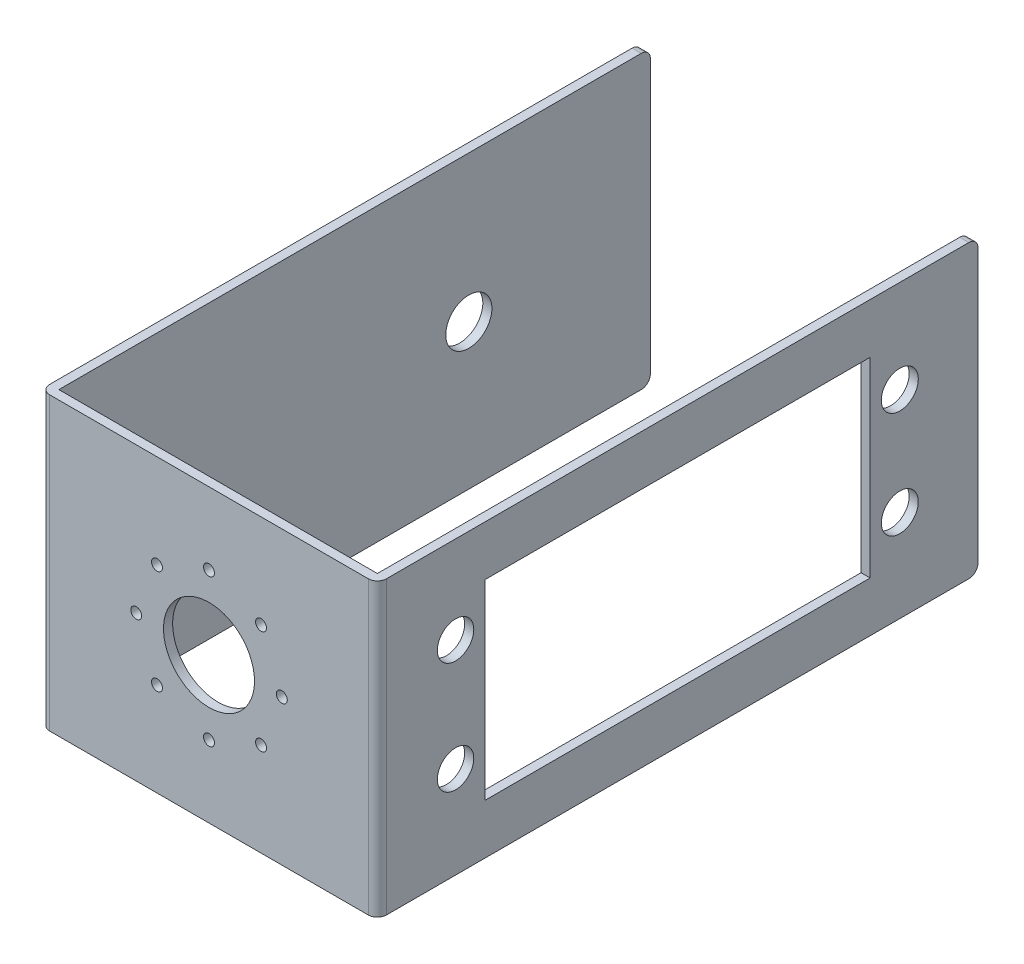
ISO-10303-21;
HEADER;
FILE_DESCRIPTION(('STEP AP214'),'2;1');
FILE_NAME('part.step','',(''),(''),'','','');
FILE_SCHEMA(('AUTOMOTIVE_DESIGN { 1 0 10303 214 1 1 1 1 }'));
ENDSEC;
DATA;
#1=APPLICATION_CONTEXT('core data for automotive mechanical design processes');
#2=APPLICATION_PROTOCOL_DEFINITION('international standard','automotive_design',2000,#1);
#3=PRODUCT_CONTEXT('',#1,'mechanical');
#4=PRODUCT('Part','Part','',(#3));
#5=PRODUCT_RELATED_PRODUCT_CATEGORY('part','',(#4));
#6=PRODUCT_DEFINITION_FORMATION('','',#4);
#7=PRODUCT_DEFINITION_CONTEXT('part definition',#1,'design');
#8=PRODUCT_DEFINITION('design','',#6,#7);
#9=PRODUCT_DEFINITION_SHAPE('','',#8);
#10=(LENGTH_UNIT() NAMED_UNIT(*) SI_UNIT(.MILLI.,.METRE.));
#11=(NAMED_UNIT(*) PLANE_ANGLE_UNIT() SI_UNIT($,.RADIAN.));
#12=(NAMED_UNIT(*) SI_UNIT($,.STERADIAN.) SOLID_ANGLE_UNIT());
#13=UNCERTAINTY_MEASURE_WITH_UNIT(LENGTH_MEASURE(1.E-05),#10,'distance_accuracy_value','');
#14=(GEOMETRIC_REPRESENTATION_CONTEXT(3) GLOBAL_UNCERTAINTY_ASSIGNED_CONTEXT((#13)) GLOBAL_UNIT_ASSIGNED_CONTEXT((#10,
#11,#12)) REPRESENTATION_CONTEXT('',''));
#15=CARTESIAN_POINT('',(0.,0.,0.));
#16=DIRECTION('',(0.,0.,1.));
#17=DIRECTION('',(1.,0.,0.));
#18=AXIS2_PLACEMENT_3D('',#15,#16,#17);
#19=CARTESIAN_POINT('',(18.5,32.,0.));
#20=DIRECTION('',(-1.,0.,0.));
#21=DIRECTION('',(0.,0.,1.));
#22=AXIS2_PLACEMENT_3D('',#19,#20,#21);
#23=PLANE('',#22);
#24=CARTESIAN_POINT('',(18.5,22.3852972044998,-7.59259474603742));
#25=DIRECTION('',(1.,0.,0.));
#26=DIRECTION('',(0.,0.,-1.));
#27=AXIS2_PLACEMENT_3D('',#24,#25,#26);
#28=CIRCLE('',#27,2.);
#29=CARTESIAN_POINT('',(18.5,22.3852972044998,-9.59259474603742));
#30=VERTEX_POINT('',#29);
#31=EDGE_CURVE('E306',#30,#30,#28,.T.);
#32=ORIENTED_EDGE('',*,*,#31,.F.);
#33=EDGE_LOOP('',(#32));
#34=FACE_BOUND('',#33,.T.);
#35=CARTESIAN_POINT('',(18.5,10.1155693309085,-7.59259474603743));
#36=DIRECTION('',(1.,0.,0.));
#37=DIRECTION('',(0.,0.,-1.));
#38=AXIS2_PLACEMENT_3D('',#35,#36,#37);
#39=CIRCLE('',#38,2.);
#40=CARTESIAN_POINT('',(18.5,10.1155693309085,-9.59259474603743));
#41=VERTEX_POINT('',#40);
#42=EDGE_CURVE('E312',#41,#41,#39,.T.);
#43=ORIENTED_EDGE('',*,*,#42,.F.);
#44=EDGE_LOOP('',(#43));
#45=FACE_BOUND('',#44,.T.);
#46=CARTESIAN_POINT('',(18.5,21.7935757158259,-56.4061379150047));
#47=DIRECTION('',(1.,0.,0.));
#48=DIRECTION('',(0.,0.,-1.));
#49=AXIS2_PLACEMENT_3D('',#46,#47,#48);
#50=CIRCLE('',#49,2.03257136074026);
#51=CARTESIAN_POINT('',(18.5,21.7935757158259,-58.438709275745));
#52=VERTEX_POINT('',#51);
#53=EDGE_CURVE('E301',#52,#52,#50,.T.);
#54=ORIENTED_EDGE('',*,*,#53,.F.);
#55=EDGE_LOOP('',(#54));
#56=FACE_BOUND('',#55,.T.);
#57=CARTESIAN_POINT('',(18.5,10.1155693309085,-56.4061379150047));
#58=DIRECTION('',(1.,0.,0.));
#59=DIRECTION('',(0.,0.,-1.));
#60=AXIS2_PLACEMENT_3D('',#57,#58,#59);
#61=CIRCLE('',#60,2.02805620219671);
#62=CARTESIAN_POINT('',(18.5,10.1155693309085,-58.4341941172014));
#63=VERTEX_POINT('',#62);
#64=EDGE_CURVE('E310',#63,#63,#61,.T.);
#65=ORIENTED_EDGE('',*,*,#64,.F.);
#66=EDGE_LOOP('',(#65));
#67=FACE_BOUND('',#66,.T.);
#68=DIRECTION('',(0.,0.,-1.));
#69=VECTOR('',#68,1.);
#70=CARTESIAN_POINT('',(18.5,5.5,-10.8525947460374));
#71=LINE('',#70,#69);
#72=CARTESIAN_POINT('',(18.5,5.5,-10.8525947460374));
#73=VERTEX_POINT('',#72);
#74=CARTESIAN_POINT('',(18.5,5.5,-53.1474052539626));
#75=VERTEX_POINT('',#74);
#76=EDGE_CURVE('E174',#73,#75,#71,.T.);
#77=ORIENTED_EDGE('',*,*,#76,.F.);
#78=DIRECTION('',(0.,-1.,0.));
#79=VECTOR('',#78,1.);
#80=CARTESIAN_POINT('',(18.5,26.5,-10.8525947460374));
#81=LINE('',#80,#79);
#82=CARTESIAN_POINT('',(18.5,26.5,-10.8525947460374));
#83=VERTEX_POINT('',#82);
#84=EDGE_CURVE('E53',#83,#73,#81,.T.);
#85=ORIENTED_EDGE('',*,*,#84,.F.);
#86=DIRECTION('',(0.,0.,1.));
#87=VECTOR('',#86,1.);
#88=CARTESIAN_POINT('',(18.5,26.5,-53.1474052539626));
#89=LINE('',#88,#87);
#90=CARTESIAN_POINT('',(18.5,26.5,-53.1474052539626));
#91=VERTEX_POINT('',#90);
#92=EDGE_CURVE('E180',#91,#83,#89,.T.);
#93=ORIENTED_EDGE('',*,*,#92,.F.);
#94=DIRECTION('',(0.,1.,0.));
#95=VECTOR('',#94,1.);
#96=CARTESIAN_POINT('',(18.5,5.5,-53.1474052539626));
#97=LINE('',#96,#95);
#98=EDGE_CURVE('E165',#75,#91,#97,.T.);
#99=ORIENTED_EDGE('',*,*,#98,.F.);
#100=EDGE_LOOP('',(#77,#85,#93,#99));
#101=FACE_BOUND('',#100,.T.);
#102=DIRECTION('',(0.,0.,-1.));
#103=VECTOR('',#102,1.);
#104=CARTESIAN_POINT('',(18.5,32.,0.));
#105=LINE('',#104,#103);
#106=CARTESIAN_POINT('',(18.5,32.,0.));
#107=VERTEX_POINT('',#106);
#108=CARTESIAN_POINT('',(18.5,32.,-64.));
#109=VERTEX_POINT('',#108);
#110=EDGE_CURVE('E190',#107,#109,#105,.T.);
#111=ORIENTED_EDGE('',*,*,#110,.F.);
#112=DIRECTION('',(0.,-1.,0.));
#113=VECTOR('',#112,1.);
#114=CARTESIAN_POINT('',(18.5,32.,0.));
#115=LINE('',#114,#113);
#116=CARTESIAN_POINT('',(18.5,0.,0.));
#117=VERTEX_POINT('',#116);
#118=EDGE_CURVE('E273',#107,#117,#115,.T.);
#119=ORIENTED_EDGE('',*,*,#118,.T.);
#120=DIRECTION('',(0.,0.,-1.));
#121=VECTOR('',#120,1.);
#122=CARTESIAN_POINT('',(18.5,0.,0.));
#123=LINE('',#122,#121);
#124=CARTESIAN_POINT('',(18.5,0.,-64.));
#125=VERTEX_POINT('',#124);
#126=EDGE_CURVE('E187',#117,#125,#123,.T.);
#127=ORIENTED_EDGE('',*,*,#126,.T.);
#128=CARTESIAN_POINT('',(18.5,1.,-64.));
#129=DIRECTION('',(-1.,0.,0.));
#130=DIRECTION('',(0.,0.,1.));
#131=AXIS2_PLACEMENT_3D('',#128,#129,#130);
#132=CIRCLE('',#131,1.);
#133=CARTESIAN_POINT('',(18.5,1.,-65.));
#134=VERTEX_POINT('',#133);
#135=EDGE_CURVE('E255',#125,#134,#132,.F.);
#136=ORIENTED_EDGE('',*,*,#135,.T.);
#137=DIRECTION('',(0.,-1.,0.));
#138=VECTOR('',#137,1.);
#139=CARTESIAN_POINT('',(18.5,32.,-65.));
#140=LINE('',#139,#138);
#141=CARTESIAN_POINT('',(18.5,31.,-65.));
#142=VERTEX_POINT('',#141);
#143=EDGE_CURVE('E230',#142,#134,#140,.T.);
#144=ORIENTED_EDGE('',*,*,#143,.F.);
#145=CARTESIAN_POINT('',(18.5,31.,-64.));
#146=DIRECTION('',(-1.,0.,0.));
#147=DIRECTION('',(0.,0.,1.));
#148=AXIS2_PLACEMENT_3D('',#145,#146,#147);
#149=CIRCLE('',#148,1.);
#150=EDGE_CURVE('E266',#142,#109,#149,.F.);
#151=ORIENTED_EDGE('',*,*,#150,.T.);
#152=EDGE_LOOP('',(#111,#119,#127,#136,#144,#151));
#153=FACE_BOUND('',#152,.T.);
#154=ADVANCED_FACE('F36',(#34,#45,#56,#67,#101,#153),#23,.F.);
#155=CARTESIAN_POINT('',(17.5,32.,-65.));
#156=DIRECTION('',(0.,0.,-1.));
#157=DIRECTION('',(-1.,0.,0.));
#158=AXIS2_PLACEMENT_3D('',#155,#156,#157);
#159=PLANE('',#158);
#160=DIRECTION('',(0.,-1.,0.));
#161=VECTOR('',#160,1.);
#162=CARTESIAN_POINT('',(17.5,32.,-65.));
#163=LINE('',#162,#161);
#164=CARTESIAN_POINT('',(17.5,31.,-65.));
#165=VERTEX_POINT('',#164);
#166=CARTESIAN_POINT('',(17.5,1.,-65.));
#167=VERTEX_POINT('',#166);
#168=EDGE_CURVE('E228',#165,#167,#163,.T.);
#169=ORIENTED_EDGE('',*,*,#168,.F.);
#170=DIRECTION('',(1.,0.,0.));
#171=VECTOR('',#170,1.);
#172=CARTESIAN_POINT('',(18.5,31.,-65.));
#173=LINE('',#172,#171);
#174=EDGE_CURVE('E263',#165,#142,#173,.T.);
#175=ORIENTED_EDGE('',*,*,#174,.T.);
#176=ORIENTED_EDGE('',*,*,#143,.T.);
#177=DIRECTION('',(1.,0.,0.));
#178=VECTOR('',#177,1.);
#179=CARTESIAN_POINT('',(17.5,1.,-65.));
#180=LINE('',#179,#178);
#181=EDGE_CURVE('E258',#134,#167,#180,.F.);
#182=ORIENTED_EDGE('',*,*,#181,.T.);
#183=EDGE_LOOP('',(#169,#175,#176,#182));
#184=FACE_BOUND('',#183,.T.);
#185=ADVANCED_FACE('F448',(#184),#159,.T.);
#186=CARTESIAN_POINT('',(17.5,32.,0.));
#187=DIRECTION('',(-1.,0.,0.));
#188=DIRECTION('',(0.,0.,1.));
#189=AXIS2_PLACEMENT_3D('',#186,#187,#188);
#190=PLANE('',#189);
#191=CARTESIAN_POINT('',(17.5,22.3852972044998,-7.59259474603742));
#192=DIRECTION('',(-1.,0.,0.));
#193=DIRECTION('',(0.,0.,1.));
#194=AXIS2_PLACEMENT_3D('',#191,#192,#193);
#195=CIRCLE('',#194,2.);
#196=CARTESIAN_POINT('',(17.5,22.3852972044998,-5.59259474603742));
#197=VERTEX_POINT('',#196);
#198=EDGE_CURVE('E40',#197,#197,#195,.T.);
#199=ORIENTED_EDGE('',*,*,#198,.F.);
#200=EDGE_LOOP('',(#199));
#201=FACE_BOUND('',#200,.T.);
#202=CARTESIAN_POINT('',(17.5,10.1155693309085,-7.59259474603743));
#203=DIRECTION('',(-1.,0.,0.));
#204=DIRECTION('',(0.,0.,1.));
#205=AXIS2_PLACEMENT_3D('',#202,#203,#204);
#206=CIRCLE('',#205,2.);
#207=CARTESIAN_POINT('',(17.5,10.1155693309085,-5.59259474603743));
#208=VERTEX_POINT('',#207);
#209=EDGE_CURVE('E304',#208,#208,#206,.T.);
#210=ORIENTED_EDGE('',*,*,#209,.F.);
#211=EDGE_LOOP('',(#210));
#212=FACE_BOUND('',#211,.T.);
#213=CARTESIAN_POINT('',(17.5,21.7935757158259,-56.4061379150047));
#214=DIRECTION('',(-1.,0.,0.));
#215=DIRECTION('',(0.,0.,1.));
#216=AXIS2_PLACEMENT_3D('',#213,#214,#215);
#217=CIRCLE('',#216,2.03257136074026);
#218=CARTESIAN_POINT('',(17.5,21.7935757158259,-54.3735665542644));
#219=VERTEX_POINT('',#218);
#220=EDGE_CURVE('E300',#219,#219,#217,.T.);
#221=ORIENTED_EDGE('',*,*,#220,.F.);
#222=EDGE_LOOP('',(#221));
#223=FACE_BOUND('',#222,.T.);
#224=CARTESIAN_POINT('',(17.5,10.1155693309085,-56.4061379150047));
#225=DIRECTION('',(-1.,0.,0.));
#226=DIRECTION('',(0.,0.,1.));
#227=AXIS2_PLACEMENT_3D('',#224,#225,#226);
#228=CIRCLE('',#227,2.02805620219671);
#229=CARTESIAN_POINT('',(17.5,10.1155693309085,-54.378081712808));
#230=VERTEX_POINT('',#229);
#231=EDGE_CURVE('E297',#230,#230,#228,.T.);
#232=ORIENTED_EDGE('',*,*,#231,.F.);
#233=EDGE_LOOP('',(#232));
#234=FACE_BOUND('',#233,.T.);
#235=DIRECTION('',(0.,1.,0.));
#236=VECTOR('',#235,1.);
#237=CARTESIAN_POINT('',(17.5,32.,-10.8525947460374));
#238=LINE('',#237,#236);
#239=CARTESIAN_POINT('',(17.5,5.5,-10.8525947460374));
#240=VERTEX_POINT('',#239);
#241=CARTESIAN_POINT('',(17.5,26.5,-10.8525947460374));
#242=VERTEX_POINT('',#241);
#243=EDGE_CURVE('E11',#240,#242,#238,.T.);
#244=ORIENTED_EDGE('',*,*,#243,.F.);
#245=DIRECTION('',(0.,0.,1.));
#246=VECTOR('',#245,1.);
#247=CARTESIAN_POINT('',(17.5,5.5,0.));
#248=LINE('',#247,#246);
#249=CARTESIAN_POINT('',(17.5,5.5,-53.1474052539626));
#250=VERTEX_POINT('',#249);
#251=EDGE_CURVE('E293',#250,#240,#248,.T.);
#252=ORIENTED_EDGE('',*,*,#251,.F.);
#253=DIRECTION('',(0.,-1.,0.));
#254=VECTOR('',#253,1.);
#255=CARTESIAN_POINT('',(17.5,32.,-53.1474052539626));
#256=LINE('',#255,#254);
#257=CARTESIAN_POINT('',(17.5,26.5,-53.1474052539626));
#258=VERTEX_POINT('',#257);
#259=EDGE_CURVE('E168',#258,#250,#256,.T.);
#260=ORIENTED_EDGE('',*,*,#259,.F.);
#261=DIRECTION('',(0.,0.,-1.));
#262=VECTOR('',#261,1.);
#263=CARTESIAN_POINT('',(17.5,26.5,0.));
#264=LINE('',#263,#262);
#265=EDGE_CURVE('E45',#242,#258,#264,.T.);
#266=ORIENTED_EDGE('',*,*,#265,.F.);
#267=EDGE_LOOP('',(#244,#252,#260,#266));
#268=FACE_BOUND('',#267,.T.);
#269=DIRECTION('',(0.,0.,-1.));
#270=VECTOR('',#269,1.);
#271=CARTESIAN_POINT('',(17.5,32.,0.));
#272=LINE('',#271,#270);
#273=CARTESIAN_POINT('',(17.5,32.,0.));
#274=VERTEX_POINT('',#273);
#275=CARTESIAN_POINT('',(17.5,32.,-64.));
#276=VERTEX_POINT('',#275);
#277=EDGE_CURVE('E192',#274,#276,#272,.T.);
#278=ORIENTED_EDGE('',*,*,#277,.T.);
#279=CARTESIAN_POINT('',(17.5,31.,-64.));
#280=DIRECTION('',(-1.,0.,0.));
#281=DIRECTION('',(0.,0.,1.));
#282=AXIS2_PLACEMENT_3D('',#279,#280,#281);
#283=CIRCLE('',#282,1.);
#284=EDGE_CURVE('E271',#276,#165,#283,.T.);
#285=ORIENTED_EDGE('',*,*,#284,.T.);
#286=ORIENTED_EDGE('',*,*,#168,.T.);
#287=CARTESIAN_POINT('',(17.5,1.,-64.));
#288=DIRECTION('',(-1.,0.,0.));
#289=DIRECTION('',(0.,0.,1.));
#290=AXIS2_PLACEMENT_3D('',#287,#288,#289);
#291=CIRCLE('',#290,1.);
#292=CARTESIAN_POINT('',(17.5,0.,-64.));
#293=VERTEX_POINT('',#292);
#294=EDGE_CURVE('E261',#167,#293,#291,.T.);
#295=ORIENTED_EDGE('',*,*,#294,.T.);
#296=DIRECTION('',(0.,0.,-1.));
#297=VECTOR('',#296,1.);
#298=CARTESIAN_POINT('',(17.5,0.,0.));
#299=LINE('',#298,#297);
#300=CARTESIAN_POINT('',(17.5,0.,0.));
#301=VERTEX_POINT('',#300);
#302=EDGE_CURVE('E208',#301,#293,#299,.T.);
#303=ORIENTED_EDGE('',*,*,#302,.F.);
#304=DIRECTION('',(0.,-1.,0.));
#305=VECTOR('',#304,1.);
#306=CARTESIAN_POINT('',(17.5,32.,0.));
#307=LINE('',#306,#305);
#308=EDGE_CURVE('E226',#274,#301,#307,.T.);
#309=ORIENTED_EDGE('',*,*,#308,.F.);
#310=EDGE_LOOP('',(#278,#285,#286,#295,#303,#309));
#311=FACE_BOUND('',#310,.T.);
#312=ADVANCED_FACE('F390',(#201,#212,#223,#234,#268,#311),#190,.T.);
#313=CARTESIAN_POINT('',(17.5,32.,0.));
#314=DIRECTION('',(0.,0.,-1.));
#315=DIRECTION('',(-1.,0.,0.));
#316=AXIS2_PLACEMENT_3D('',#313,#314,#315);
#317=PLANE('',#316);
#318=CARTESIAN_POINT('',(-8.,16.,0.));
#319=DIRECTION('',(0.,0.,-1.));
#320=DIRECTION('',(-1.,0.,0.));
#321=AXIS2_PLACEMENT_3D('',#318,#319,#320);
#322=CIRCLE('',#321,0.6);
#323=CARTESIAN_POINT('',(-8.6,16.,0.));
#324=VERTEX_POINT('',#323);
#325=EDGE_CURVE('E337',#324,#324,#322,.T.);
#326=ORIENTED_EDGE('',*,*,#325,.F.);
#327=EDGE_LOOP('',(#326));
#328=FACE_BOUND('',#327,.T.);
#329=CARTESIAN_POINT('',(8.,16.,0.));
#330=DIRECTION('',(0.,0.,-1.));
#331=DIRECTION('',(-1.,0.,0.));
#332=AXIS2_PLACEMENT_3D('',#329,#330,#331);
#333=CIRCLE('',#332,0.6);
#334=CARTESIAN_POINT('',(7.4,16.,0.));
#335=VERTEX_POINT('',#334);
#336=EDGE_CURVE('E332',#335,#335,#333,.T.);
#337=ORIENTED_EDGE('',*,*,#336,.F.);
#338=EDGE_LOOP('',(#337));
#339=FACE_BOUND('',#338,.T.);
#340=CARTESIAN_POINT('',(0.,7.91489241547921,0.));
#341=DIRECTION('',(0.,0.,-1.));
#342=DIRECTION('',(-1.,0.,0.));
#343=AXIS2_PLACEMENT_3D('',#340,#341,#342);
#344=CIRCLE('',#343,0.6);
#345=CARTESIAN_POINT('',(-0.6,7.91489241547921,0.));
#346=VERTEX_POINT('',#345);
#347=EDGE_CURVE('E373',#346,#346,#344,.T.);
#348=ORIENTED_EDGE('',*,*,#347,.F.);
#349=EDGE_LOOP('',(#348));
#350=FACE_BOUND('',#349,.T.);
#351=CARTESIAN_POINT('',(5.71703439963743,21.7170343996374,0.));
#352=DIRECTION('',(0.,0.,-1.));
#353=DIRECTION('',(-1.,0.,0.));
#354=AXIS2_PLACEMENT_3D('',#351,#352,#353);
#355=CIRCLE('',#354,0.6);
#356=CARTESIAN_POINT('',(5.11703439963743,21.7170343996374,0.));
#357=VERTEX_POINT('',#356);
#358=EDGE_CURVE('E370',#357,#357,#355,.T.);
#359=ORIENTED_EDGE('',*,*,#358,.F.);
#360=EDGE_LOOP('',(#359));
#361=FACE_BOUND('',#360,.T.);
#362=CARTESIAN_POINT('',(0.,24.0851075845208,0.));
#363=DIRECTION('',(0.,0.,-1.));
#364=DIRECTION('',(-1.,0.,0.));
#365=AXIS2_PLACEMENT_3D('',#362,#363,#364);
#366=CIRCLE('',#365,0.6);
#367=CARTESIAN_POINT('',(-0.6,24.0851075845208,0.));
#368=VERTEX_POINT('',#367);
#369=EDGE_CURVE('E367',#368,#368,#366,.T.);
#370=ORIENTED_EDGE('',*,*,#369,.F.);
#371=EDGE_LOOP('',(#370));
#372=FACE_BOUND('',#371,.T.);
#373=CARTESIAN_POINT('',(-5.71703439963739,10.2829656003625,0.));
#374=DIRECTION('',(0.,0.,-1.));
#375=DIRECTION('',(-1.,0.,0.));
#376=AXIS2_PLACEMENT_3D('',#373,#374,#375);
#377=CIRCLE('',#376,0.6);
#378=CARTESIAN_POINT('',(-6.31703439963739,10.2829656003625,0.));
#379=VERTEX_POINT('',#378);
#380=EDGE_CURVE('E364',#379,#379,#377,.T.);
#381=ORIENTED_EDGE('',*,*,#380,.F.);
#382=EDGE_LOOP('',(#381));
#383=FACE_BOUND('',#382,.T.);
#384=CARTESIAN_POINT('',(-5.71703439963747,21.7170343996374,0.));
#385=DIRECTION('',(0.,0.,-1.));
#386=DIRECTION('',(-1.,0.,0.));
#387=AXIS2_PLACEMENT_3D('',#384,#385,#386);
#388=CIRCLE('',#387,0.6);
#389=CARTESIAN_POINT('',(-6.31703439963747,21.7170343996374,0.));
#390=VERTEX_POINT('',#389);
#391=EDGE_CURVE('E361',#390,#390,#388,.T.);
#392=ORIENTED_EDGE('',*,*,#391,.F.);
#393=EDGE_LOOP('',(#392));
#394=FACE_BOUND('',#393,.T.);
#395=CARTESIAN_POINT('',(5.71703439963746,10.2829656003626,0.));
#396=DIRECTION('',(0.,0.,-1.));
#397=DIRECTION('',(-1.,0.,0.));
#398=AXIS2_PLACEMENT_3D('',#395,#396,#397);
#399=CIRCLE('',#398,0.6);
#400=CARTESIAN_POINT('',(5.11703439963746,10.2829656003626,0.));
#401=VERTEX_POINT('',#400);
#402=EDGE_CURVE('E344',#401,#401,#399,.T.);
#403=ORIENTED_EDGE('',*,*,#402,.F.);
#404=EDGE_LOOP('',(#403));
#405=FACE_BOUND('',#404,.T.);
#406=CARTESIAN_POINT('',(0.,16.,0.));
#407=DIRECTION('',(0.,0.,-1.));
#408=DIRECTION('',(-1.,0.,0.));
#409=AXIS2_PLACEMENT_3D('',#406,#407,#408);
#410=CIRCLE('',#409,5.);
#411=CARTESIAN_POINT('',(-5.,16.,0.));
#412=VERTEX_POINT('',#411);
#413=EDGE_CURVE('E379',#412,#412,#410,.T.);
#414=ORIENTED_EDGE('',*,*,#413,.F.);
#415=EDGE_LOOP('',(#414));
#416=FACE_BOUND('',#415,.T.);
#417=DIRECTION('',(1.,0.,0.));
#418=VECTOR('',#417,1.);
#419=CARTESIAN_POINT('',(17.5,0.,0.));
#420=LINE('',#419,#418);
#421=CARTESIAN_POINT('',(-17.5,0.,0.));
#422=VERTEX_POINT('',#421);
#423=EDGE_CURVE('E211',#422,#301,#420,.T.);
#424=ORIENTED_EDGE('',*,*,#423,.F.);
#425=DIRECTION('',(0.,-1.,0.));
#426=VECTOR('',#425,1.);
#427=CARTESIAN_POINT('',(-17.5,32.,0.));
#428=LINE('',#427,#426);
#429=CARTESIAN_POINT('',(-17.5,32.,0.));
#430=VERTEX_POINT('',#429);
#431=EDGE_CURVE('E223',#430,#422,#428,.T.);
#432=ORIENTED_EDGE('',*,*,#431,.F.);
#433=DIRECTION('',(1.,0.,0.));
#434=VECTOR('',#433,1.);
#435=CARTESIAN_POINT('',(17.5,32.,0.));
#436=LINE('',#435,#434);
#437=EDGE_CURVE('E196',#430,#274,#436,.T.);
#438=ORIENTED_EDGE('',*,*,#437,.T.);
#439=ORIENTED_EDGE('',*,*,#308,.T.);
#440=EDGE_LOOP('',(#424,#432,#438,#439));
#441=FACE_BOUND('',#440,.T.);
#442=ADVANCED_FACE('F386',(#328,#339,#350,#361,#372,#383,#394,#405,#416,#441),#317,.T.);
#443=CARTESIAN_POINT('',(-17.5,32.,0.));
#444=DIRECTION('',(1.,0.,0.));
#445=DIRECTION('',(0.,0.,-1.));
#446=AXIS2_PLACEMENT_3D('',#443,#444,#445);
#447=PLANE('',#446);
#448=CARTESIAN_POINT('',(-17.5,15.9397673385797,-45.049639152019));
#449=DIRECTION('',(1.,0.,0.));
#450=DIRECTION('',(0.,0.,-1.));
#451=AXIS2_PLACEMENT_3D('',#448,#449,#450);
#452=CIRCLE('',#451,2.53599158662607);
#453=CARTESIAN_POINT('',(-17.5,15.9397673385797,-47.5856307386451));
#454=VERTEX_POINT('',#453);
#455=EDGE_CURVE('E325',#454,#454,#452,.T.);
#456=ORIENTED_EDGE('',*,*,#455,.F.);
#457=EDGE_LOOP('',(#456));
#458=FACE_BOUND('',#457,.T.);
#459=DIRECTION('',(0.,-1.,0.));
#460=VECTOR('',#459,1.);
#461=CARTESIAN_POINT('',(-17.5,32.,-65.));
#462=LINE('',#461,#460);
#463=CARTESIAN_POINT('',(-17.5,31.,-65.));
#464=VERTEX_POINT('',#463);
#465=CARTESIAN_POINT('',(-17.5,1.,-65.));
#466=VERTEX_POINT('',#465);
#467=EDGE_CURVE('E221',#464,#466,#462,.T.);
#468=ORIENTED_EDGE('',*,*,#467,.F.);
#469=CARTESIAN_POINT('',(-17.5,31.,-64.));
#470=DIRECTION('',(1.,0.,0.));
#471=DIRECTION('',(0.,0.,-1.));
#472=AXIS2_PLACEMENT_3D('',#469,#470,#471);
#473=CIRCLE('',#472,1.);
#474=CARTESIAN_POINT('',(-17.5,32.,-64.));
#475=VERTEX_POINT('',#474);
#476=EDGE_CURVE('E246',#464,#475,#473,.T.);
#477=ORIENTED_EDGE('',*,*,#476,.T.);
#478=DIRECTION('',(0.,0.,1.));
#479=VECTOR('',#478,1.);
#480=CARTESIAN_POINT('',(-17.5,32.,0.));
#481=LINE('',#480,#479);
#482=EDGE_CURVE('E199',#475,#430,#481,.T.);
#483=ORIENTED_EDGE('',*,*,#482,.T.);
#484=ORIENTED_EDGE('',*,*,#431,.T.);
#485=DIRECTION('',(0.,0.,1.));
#486=VECTOR('',#485,1.);
#487=CARTESIAN_POINT('',(-17.5,0.,0.));
#488=LINE('',#487,#486);
#489=CARTESIAN_POINT('',(-17.5,0.,-64.));
#490=VERTEX_POINT('',#489);
#491=EDGE_CURVE('E214',#490,#422,#488,.T.);
#492=ORIENTED_EDGE('',*,*,#491,.F.);
#493=CARTESIAN_POINT('',(-17.5,1.,-64.));
#494=DIRECTION('',(1.,0.,0.));
#495=DIRECTION('',(0.,0.,-1.));
#496=AXIS2_PLACEMENT_3D('',#493,#494,#495);
#497=CIRCLE('',#496,1.);
#498=EDGE_CURVE('E235',#490,#466,#497,.T.);
#499=ORIENTED_EDGE('',*,*,#498,.T.);
#500=EDGE_LOOP('',(#468,#477,#483,#484,#492,#499));
#501=FACE_BOUND('',#500,.T.);
#502=ADVANCED_FACE('F389',(#458,#501),#447,.T.);
#503=CARTESIAN_POINT('',(-18.5,32.,-65.));
#504=DIRECTION('',(0.,0.,-1.));
#505=DIRECTION('',(-1.,0.,0.));
#506=AXIS2_PLACEMENT_3D('',#503,#504,#505);
#507=PLANE('',#506);
#508=DIRECTION('',(0.,-1.,0.));
#509=VECTOR('',#508,1.);
#510=CARTESIAN_POINT('',(-18.5,32.,-65.));
#511=LINE('',#510,#509);
#512=CARTESIAN_POINT('',(-18.5,31.,-65.));
#513=VERTEX_POINT('',#512);
#514=CARTESIAN_POINT('',(-18.5,1.,-65.));
#515=VERTEX_POINT('',#514);
#516=EDGE_CURVE('E206',#513,#515,#511,.T.);
#517=ORIENTED_EDGE('',*,*,#516,.F.);
#518=DIRECTION('',(1.,0.,0.));
#519=VECTOR('',#518,1.);
#520=CARTESIAN_POINT('',(-17.5,31.,-65.));
#521=LINE('',#520,#519);
#522=EDGE_CURVE('E243',#513,#464,#521,.T.);
#523=ORIENTED_EDGE('',*,*,#522,.T.);
#524=ORIENTED_EDGE('',*,*,#467,.T.);
#525=DIRECTION('',(1.,0.,0.));
#526=VECTOR('',#525,1.);
#527=CARTESIAN_POINT('',(-18.5,1.,-65.));
#528=LINE('',#527,#526);
#529=EDGE_CURVE('E238',#466,#515,#528,.F.);
#530=ORIENTED_EDGE('',*,*,#529,.T.);
#531=EDGE_LOOP('',(#517,#523,#524,#530));
#532=FACE_BOUND('',#531,.T.);
#533=ADVANCED_FACE('F420',(#532),#507,.T.);
#534=CARTESIAN_POINT('',(-18.5,32.,0.));
#535=DIRECTION('',(1.,0.,0.));
#536=DIRECTION('',(0.,0.,-1.));
#537=AXIS2_PLACEMENT_3D('',#534,#535,#536);
#538=PLANE('',#537);
#539=CARTESIAN_POINT('',(-18.5,15.9397673385797,-45.049639152019));
#540=DIRECTION('',(-1.,0.,0.));
#541=DIRECTION('',(0.,0.,1.));
#542=AXIS2_PLACEMENT_3D('',#539,#540,#541);
#543=CIRCLE('',#542,2.53599158662607);
#544=CARTESIAN_POINT('',(-18.5,15.9397673385797,-42.5136475653929));
#545=VERTEX_POINT('',#544);
#546=EDGE_CURVE('E303',#545,#545,#543,.T.);
#547=ORIENTED_EDGE('',*,*,#546,.F.);
#548=EDGE_LOOP('',(#547));
#549=FACE_BOUND('',#548,.T.);
#550=DIRECTION('',(0.,0.,-1.));
#551=VECTOR('',#550,1.);
#552=CARTESIAN_POINT('',(-18.5,0.,0.));
#553=LINE('',#552,#551);
#554=CARTESIAN_POINT('',(-18.5,0.,-64.));
#555=VERTEX_POINT('',#554);
#556=CARTESIAN_POINT('',(-18.5,0.,0.));
#557=VERTEX_POINT('',#556);
#558=EDGE_CURVE('E216',#555,#557,#553,.F.);
#559=ORIENTED_EDGE('',*,*,#558,.T.);
#560=DIRECTION('',(0.,-1.,0.));
#561=VECTOR('',#560,1.);
#562=CARTESIAN_POINT('',(-18.5,32.,0.));
#563=LINE('',#562,#561);
#564=CARTESIAN_POINT('',(-18.5,32.,0.));
#565=VERTEX_POINT('',#564);
#566=EDGE_CURVE('E289',#557,#565,#563,.F.);
#567=ORIENTED_EDGE('',*,*,#566,.T.);
#568=DIRECTION('',(0.,0.,-1.));
#569=VECTOR('',#568,1.);
#570=CARTESIAN_POINT('',(-18.5,32.,0.));
#571=LINE('',#570,#569);
#572=CARTESIAN_POINT('',(-18.5,32.,-64.));
#573=VERTEX_POINT('',#572);
#574=EDGE_CURVE('E201',#573,#565,#571,.F.);
#575=ORIENTED_EDGE('',*,*,#574,.F.);
#576=CARTESIAN_POINT('',(-18.5,31.,-64.));
#577=DIRECTION('',(1.,0.,0.));
#578=DIRECTION('',(0.,0.,-1.));
#579=AXIS2_PLACEMENT_3D('',#576,#577,#578);
#580=CIRCLE('',#579,1.);
#581=EDGE_CURVE('E250',#573,#513,#580,.F.);
#582=ORIENTED_EDGE('',*,*,#581,.T.);
#583=ORIENTED_EDGE('',*,*,#516,.T.);
#584=CARTESIAN_POINT('',(-18.5,1.,-64.));
#585=DIRECTION('',(1.,0.,0.));
#586=DIRECTION('',(0.,0.,-1.));
#587=AXIS2_PLACEMENT_3D('',#584,#585,#586);
#588=CIRCLE('',#587,1.);
#589=EDGE_CURVE('E241',#515,#555,#588,.F.);
#590=ORIENTED_EDGE('',*,*,#589,.T.);
#591=EDGE_LOOP('',(#559,#567,#575,#582,#583,#590));
#592=FACE_BOUND('',#591,.T.);
#593=ADVANCED_FACE('F418',(#549,#592),#538,.F.);
#594=CARTESIAN_POINT('',(17.5,32.,0.999999999999994));
#595=DIRECTION('',(0.,0.,-1.));
#596=DIRECTION('',(-1.,0.,0.));
#597=AXIS2_PLACEMENT_3D('',#594,#595,#596);
#598=PLANE('',#597);
#599=CARTESIAN_POINT('',(-8.,16.,1.));
#600=DIRECTION('',(0.,0.,1.));
#601=DIRECTION('',(1.,0.,0.));
#602=AXIS2_PLACEMENT_3D('',#599,#600,#601);
#603=CIRCLE('',#602,0.6);
#604=CARTESIAN_POINT('',(-7.4,16.,1.));
#605=VERTEX_POINT('',#604);
#606=EDGE_CURVE('E329',#605,#605,#603,.T.);
#607=ORIENTED_EDGE('',*,*,#606,.F.);
#608=EDGE_LOOP('',(#607));
#609=FACE_BOUND('',#608,.T.);
#610=CARTESIAN_POINT('',(8.,16.,1.));
#611=DIRECTION('',(0.,0.,1.));
#612=DIRECTION('',(1.,0.,0.));
#613=AXIS2_PLACEMENT_3D('',#610,#611,#612);
#614=CIRCLE('',#613,0.6);
#615=CARTESIAN_POINT('',(8.6,16.,1.));
#616=VERTEX_POINT('',#615);
#617=EDGE_CURVE('E328',#616,#616,#614,.T.);
#618=ORIENTED_EDGE('',*,*,#617,.F.);
#619=EDGE_LOOP('',(#618));
#620=FACE_BOUND('',#619,.T.);
#621=CARTESIAN_POINT('',(0.,7.91489241547921,1.));
#622=DIRECTION('',(0.,0.,1.));
#623=DIRECTION('',(1.,0.,0.));
#624=AXIS2_PLACEMENT_3D('',#621,#622,#623);
#625=CIRCLE('',#624,0.6);
#626=CARTESIAN_POINT('',(0.6,7.91489241547921,1.));
#627=VERTEX_POINT('',#626);
#628=EDGE_CURVE('E341',#627,#627,#625,.T.);
#629=ORIENTED_EDGE('',*,*,#628,.F.);
#630=EDGE_LOOP('',(#629));
#631=FACE_BOUND('',#630,.T.);
#632=CARTESIAN_POINT('',(5.71703439963743,21.7170343996374,1.));
#633=DIRECTION('',(0.,0.,1.));
#634=DIRECTION('',(1.,0.,0.));
#635=AXIS2_PLACEMENT_3D('',#632,#633,#634);
#636=CIRCLE('',#635,0.6);
#637=CARTESIAN_POINT('',(6.31703439963743,21.7170343996374,1.));
#638=VERTEX_POINT('',#637);
#639=EDGE_CURVE('E340',#638,#638,#636,.T.);
#640=ORIENTED_EDGE('',*,*,#639,.F.);
#641=EDGE_LOOP('',(#640));
#642=FACE_BOUND('',#641,.T.);
#643=CARTESIAN_POINT('',(0.,24.0851075845208,1.));
#644=DIRECTION('',(0.,0.,1.));
#645=DIRECTION('',(1.,0.,0.));
#646=AXIS2_PLACEMENT_3D('',#643,#644,#645);
#647=CIRCLE('',#646,0.6);
#648=CARTESIAN_POINT('',(0.6,24.0851075845208,1.));
#649=VERTEX_POINT('',#648);
#650=EDGE_CURVE('E345',#649,#649,#647,.T.);
#651=ORIENTED_EDGE('',*,*,#650,.F.);
#652=EDGE_LOOP('',(#651));
#653=FACE_BOUND('',#652,.T.);
#654=CARTESIAN_POINT('',(-5.71703439963739,10.2829656003625,1.));
#655=DIRECTION('',(0.,0.,1.));
#656=DIRECTION('',(1.,0.,0.));
#657=AXIS2_PLACEMENT_3D('',#654,#655,#656);
#658=CIRCLE('',#657,0.6);
#659=CARTESIAN_POINT('',(-5.11703439963739,10.2829656003625,1.));
#660=VERTEX_POINT('',#659);
#661=EDGE_CURVE('E352',#660,#660,#658,.T.);
#662=ORIENTED_EDGE('',*,*,#661,.F.);
#663=EDGE_LOOP('',(#662));
#664=FACE_BOUND('',#663,.T.);
#665=CARTESIAN_POINT('',(-5.71703439963747,21.7170343996374,1.));
#666=DIRECTION('',(0.,0.,1.));
#667=DIRECTION('',(1.,0.,0.));
#668=AXIS2_PLACEMENT_3D('',#665,#666,#667);
#669=CIRCLE('',#668,0.6);
#670=CARTESIAN_POINT('',(-5.11703439963747,21.7170343996374,1.));
#671=VERTEX_POINT('',#670);
#672=EDGE_CURVE('E349',#671,#671,#669,.T.);
#673=ORIENTED_EDGE('',*,*,#672,.F.);
#674=EDGE_LOOP('',(#673));
#675=FACE_BOUND('',#674,.T.);
#676=CARTESIAN_POINT('',(5.71703439963746,10.2829656003626,1.));
#677=DIRECTION('',(0.,0.,1.));
#678=DIRECTION('',(1.,0.,0.));
#679=AXIS2_PLACEMENT_3D('',#676,#677,#678);
#680=CIRCLE('',#679,0.6);
#681=CARTESIAN_POINT('',(6.31703439963746,10.2829656003626,1.));
#682=VERTEX_POINT('',#681);
#683=EDGE_CURVE('E348',#682,#682,#680,.T.);
#684=ORIENTED_EDGE('',*,*,#683,.F.);
#685=EDGE_LOOP('',(#684));
#686=FACE_BOUND('',#685,.T.);
#687=CARTESIAN_POINT('',(0.,16.,1.));
#688=DIRECTION('',(0.,0.,1.));
#689=DIRECTION('',(1.,0.,0.));
#690=AXIS2_PLACEMENT_3D('',#687,#688,#689);
#691=CIRCLE('',#690,5.);
#692=CARTESIAN_POINT('',(5.,16.,1.));
#693=VERTEX_POINT('',#692);
#694=EDGE_CURVE('E376',#693,#693,#691,.T.);
#695=ORIENTED_EDGE('',*,*,#694,.F.);
#696=EDGE_LOOP('',(#695));
#697=FACE_BOUND('',#696,.T.);
#698=DIRECTION('',(1.,0.,0.));
#699=VECTOR('',#698,1.);
#700=CARTESIAN_POINT('',(17.5,32.,0.999999999999994));
#701=LINE('',#700,#699);
#702=CARTESIAN_POINT('',(-17.5,32.,1.00000000000001));
#703=VERTEX_POINT('',#702);
#704=CARTESIAN_POINT('',(17.5,32.,0.999999999999994));
#705=VERTEX_POINT('',#704);
#706=EDGE_CURVE('E204',#703,#705,#701,.T.);
#707=ORIENTED_EDGE('',*,*,#706,.F.);
#708=DIRECTION('',(0.,-1.,0.));
#709=VECTOR('',#708,1.);
#710=CARTESIAN_POINT('',(-17.5,32.,1.00000000000001));
#711=LINE('',#710,#709);
#712=CARTESIAN_POINT('',(-17.5,0.,1.00000000000001));
#713=VERTEX_POINT('',#712);
#714=EDGE_CURVE('E284',#703,#713,#711,.T.);
#715=ORIENTED_EDGE('',*,*,#714,.T.);
#716=DIRECTION('',(1.,0.,0.));
#717=VECTOR('',#716,1.);
#718=CARTESIAN_POINT('',(17.5,0.,0.999999999999994));
#719=LINE('',#718,#717);
#720=CARTESIAN_POINT('',(17.5,0.,0.999999999999994));
#721=VERTEX_POINT('',#720);
#722=EDGE_CURVE('E193',#713,#721,#719,.T.);
#723=ORIENTED_EDGE('',*,*,#722,.T.);
#724=DIRECTION('',(0.,-1.,0.));
#725=VECTOR('',#724,1.);
#726=CARTESIAN_POINT('',(17.5,32.,0.999999999999994));
#727=LINE('',#726,#725);
#728=EDGE_CURVE('E279',#721,#705,#727,.F.);
#729=ORIENTED_EDGE('',*,*,#728,.T.);
#730=EDGE_LOOP('',(#707,#715,#723,#729));
#731=FACE_BOUND('',#730,.T.);
#732=ADVANCED_FACE('F431',(#609,#620,#631,#642,#653,#664,#675,#686,#697,#731),#598,.F.);
#733=CARTESIAN_POINT('',(0.,32.,0.));
#734=DIRECTION('',(0.,-1.,0.));
#735=DIRECTION('',(-1.,0.,0.));
#736=AXIS2_PLACEMENT_3D('',#733,#734,#735);
#737=PLANE('',#736);
#738=ORIENTED_EDGE('',*,*,#574,.T.);
#739=CARTESIAN_POINT('',(-17.5,32.,0.));
#740=DIRECTION('',(0.,-1.,0.));
#741=DIRECTION('',(0.,0.,-1.));
#742=AXIS2_PLACEMENT_3D('',#739,#740,#741);
#743=CIRCLE('',#742,1.);
#744=EDGE_CURVE('E291',#565,#703,#743,.F.);
#745=ORIENTED_EDGE('',*,*,#744,.T.);
#746=ORIENTED_EDGE('',*,*,#706,.T.);
#747=CARTESIAN_POINT('',(17.5,32.,0.));
#748=DIRECTION('',(0.,-1.,0.));
#749=DIRECTION('',(0.,0.,-1.));
#750=AXIS2_PLACEMENT_3D('',#747,#748,#749);
#751=CIRCLE('',#750,1.);
#752=EDGE_CURVE('E282',#705,#107,#751,.F.);
#753=ORIENTED_EDGE('',*,*,#752,.T.);
#754=ORIENTED_EDGE('',*,*,#110,.T.);
#755=DIRECTION('',(1.,0.,0.));
#756=VECTOR('',#755,1.);
#757=CARTESIAN_POINT('',(17.5,32.,-64.));
#758=LINE('',#757,#756);
#759=EDGE_CURVE('E269',#109,#276,#758,.F.);
#760=ORIENTED_EDGE('',*,*,#759,.T.);
#761=ORIENTED_EDGE('',*,*,#277,.F.);
#762=ORIENTED_EDGE('',*,*,#437,.F.);
#763=ORIENTED_EDGE('',*,*,#482,.F.);
#764=DIRECTION('',(1.,0.,0.));
#765=VECTOR('',#764,1.);
#766=CARTESIAN_POINT('',(-18.5,32.,-64.));
#767=LINE('',#766,#765);
#768=EDGE_CURVE('E248',#475,#573,#767,.F.);
#769=ORIENTED_EDGE('',*,*,#768,.T.);
#770=EDGE_LOOP('',(#738,#745,#746,#753,#754,#760,#761,#762,#763,#769));
#771=FACE_BOUND('',#770,.T.);
#772=ADVANCED_FACE('F409',(#771),#737,.F.);
#773=CARTESIAN_POINT('',(0.,0.,0.));
#774=DIRECTION('',(0.,-1.,0.));
#775=DIRECTION('',(-1.,0.,0.));
#776=AXIS2_PLACEMENT_3D('',#773,#774,#775);
#777=PLANE('',#776);
#778=ORIENTED_EDGE('',*,*,#722,.F.);
#779=CARTESIAN_POINT('',(-17.5,0.,0.));
#780=DIRECTION('',(0.,-1.,0.));
#781=DIRECTION('',(0.,0.,-1.));
#782=AXIS2_PLACEMENT_3D('',#779,#780,#781);
#783=CIRCLE('',#782,1.);
#784=EDGE_CURVE('E287',#713,#557,#783,.T.);
#785=ORIENTED_EDGE('',*,*,#784,.T.);
#786=ORIENTED_EDGE('',*,*,#558,.F.);
#787=DIRECTION('',(1.,0.,0.));
#788=VECTOR('',#787,1.);
#789=CARTESIAN_POINT('',(0.,0.,-64.));
#790=LINE('',#789,#788);
#791=EDGE_CURVE('E232',#555,#490,#790,.T.);
#792=ORIENTED_EDGE('',*,*,#791,.T.);
#793=ORIENTED_EDGE('',*,*,#491,.T.);
#794=ORIENTED_EDGE('',*,*,#423,.T.);
#795=ORIENTED_EDGE('',*,*,#302,.T.);
#796=DIRECTION('',(1.,0.,0.));
#797=VECTOR('',#796,1.);
#798=CARTESIAN_POINT('',(0.,0.,-64.));
#799=LINE('',#798,#797);
#800=EDGE_CURVE('E252',#293,#125,#799,.T.);
#801=ORIENTED_EDGE('',*,*,#800,.T.);
#802=ORIENTED_EDGE('',*,*,#126,.F.);
#803=CARTESIAN_POINT('',(17.5,0.,0.));
#804=DIRECTION('',(0.,-1.,0.));
#805=DIRECTION('',(0.,0.,-1.));
#806=AXIS2_PLACEMENT_3D('',#803,#804,#805);
#807=CIRCLE('',#806,1.);
#808=EDGE_CURVE('E276',#117,#721,#807,.T.);
#809=ORIENTED_EDGE('',*,*,#808,.T.);
#810=EDGE_LOOP('',(#778,#785,#786,#792,#793,#794,#795,#801,#802,#809));
#811=FACE_BOUND('',#810,.T.);
#812=ADVANCED_FACE('F399',(#811),#777,.T.);
#813=CARTESIAN_POINT('',(0.,1.,-64.));
#814=DIRECTION('',(1.,0.,0.));
#815=DIRECTION('',(0.,0.,-1.));
#816=AXIS2_PLACEMENT_3D('',#813,#814,#815);
#817=CYLINDRICAL_SURFACE('',#816,1.);
#818=ORIENTED_EDGE('',*,*,#589,.F.);
#819=ORIENTED_EDGE('',*,*,#529,.F.);
#820=ORIENTED_EDGE('',*,*,#498,.F.);
#821=ORIENTED_EDGE('',*,*,#791,.F.);
#822=EDGE_LOOP('',(#818,#819,#820,#821));
#823=FACE_BOUND('',#822,.T.);
#824=ADVANCED_FACE('F424',(#823),#817,.T.);
#825=CARTESIAN_POINT('',(-18.5,31.,-64.));
#826=DIRECTION('',(-1.,0.,0.));
#827=DIRECTION('',(0.,0.,1.));
#828=AXIS2_PLACEMENT_3D('',#825,#826,#827);
#829=CYLINDRICAL_SURFACE('',#828,1.);
#830=ORIENTED_EDGE('',*,*,#581,.F.);
#831=ORIENTED_EDGE('',*,*,#768,.F.);
#832=ORIENTED_EDGE('',*,*,#476,.F.);
#833=ORIENTED_EDGE('',*,*,#522,.F.);
#834=EDGE_LOOP('',(#830,#831,#832,#833));
#835=FACE_BOUND('',#834,.T.);
#836=ADVANCED_FACE('F414',(#835),#829,.T.);
#837=CARTESIAN_POINT('',(0.,1.,-64.));
#838=DIRECTION('',(1.,0.,0.));
#839=DIRECTION('',(0.,0.,-1.));
#840=AXIS2_PLACEMENT_3D('',#837,#838,#839);
#841=CYLINDRICAL_SURFACE('',#840,1.);
#842=ORIENTED_EDGE('',*,*,#294,.F.);
#843=ORIENTED_EDGE('',*,*,#181,.F.);
#844=ORIENTED_EDGE('',*,*,#135,.F.);
#845=ORIENTED_EDGE('',*,*,#800,.F.);
#846=EDGE_LOOP('',(#842,#843,#844,#845));
#847=FACE_BOUND('',#846,.T.);
#848=ADVANCED_FACE('F445',(#847),#841,.T.);
#849=CARTESIAN_POINT('',(17.5,31.,-64.));
#850=DIRECTION('',(-1.,0.,0.));
#851=DIRECTION('',(0.,0.,1.));
#852=AXIS2_PLACEMENT_3D('',#849,#850,#851);
#853=CYLINDRICAL_SURFACE('',#852,1.);
#854=ORIENTED_EDGE('',*,*,#284,.F.);
#855=ORIENTED_EDGE('',*,*,#759,.F.);
#856=ORIENTED_EDGE('',*,*,#150,.F.);
#857=ORIENTED_EDGE('',*,*,#174,.F.);
#858=EDGE_LOOP('',(#854,#855,#856,#857));
#859=FACE_BOUND('',#858,.T.);
#860=ADVANCED_FACE('F452',(#859),#853,.T.);
#861=CARTESIAN_POINT('',(17.5,32.,0.));
#862=DIRECTION('',(0.,-1.,0.));
#863=DIRECTION('',(0.,0.,-1.));
#864=AXIS2_PLACEMENT_3D('',#861,#862,#863);
#865=CYLINDRICAL_SURFACE('',#864,1.);
#866=ORIENTED_EDGE('',*,*,#752,.F.);
#867=ORIENTED_EDGE('',*,*,#728,.F.);
#868=ORIENTED_EDGE('',*,*,#808,.F.);
#869=ORIENTED_EDGE('',*,*,#118,.F.);
#870=EDGE_LOOP('',(#866,#867,#868,#869));
#871=FACE_BOUND('',#870,.T.);
#872=ADVANCED_FACE('F440',(#871),#865,.T.);
#873=CARTESIAN_POINT('',(-17.5,32.,0.));
#874=DIRECTION('',(0.,-1.,0.));
#875=DIRECTION('',(0.,0.,-1.));
#876=AXIS2_PLACEMENT_3D('',#873,#874,#875);
#877=CYLINDRICAL_SURFACE('',#876,1.);
#878=ORIENTED_EDGE('',*,*,#744,.F.);
#879=ORIENTED_EDGE('',*,*,#566,.F.);
#880=ORIENTED_EDGE('',*,*,#784,.F.);
#881=ORIENTED_EDGE('',*,*,#714,.F.);
#882=EDGE_LOOP('',(#878,#879,#880,#881));
#883=FACE_BOUND('',#882,.T.);
#884=ADVANCED_FACE('F38',(#883),#877,.T.);
#885=CARTESIAN_POINT('',(-13.5,26.5,-10.8525947460374));
#886=DIRECTION('',(0.,0.,1.));
#887=DIRECTION('',(1.,0.,0.));
#888=AXIS2_PLACEMENT_3D('',#885,#886,#887);
#889=PLANE('',#888);
#890=ORIENTED_EDGE('',*,*,#243,.T.);
#891=DIRECTION('',(1.,0.,0.));
#892=VECTOR('',#891,1.);
#893=CARTESIAN_POINT('',(-13.5,26.5,-10.8525947460374));
#894=LINE('',#893,#892);
#895=EDGE_CURVE('E185',#242,#83,#894,.T.);
#896=ORIENTED_EDGE('',*,*,#895,.T.);
#897=ORIENTED_EDGE('',*,*,#84,.T.);
#898=DIRECTION('',(1.,0.,0.));
#899=VECTOR('',#898,1.);
#900=CARTESIAN_POINT('',(-13.5,5.5,-10.8525947460374));
#901=LINE('',#900,#899);
#902=EDGE_CURVE('E171',#240,#73,#901,.T.);
#903=ORIENTED_EDGE('',*,*,#902,.F.);
#904=EDGE_LOOP('',(#890,#896,#897,#903));
#905=FACE_BOUND('',#904,.T.);
#906=ADVANCED_FACE('F481',(#905),#889,.F.);
#907=CARTESIAN_POINT('',(-13.5,26.5,-53.1474052539626));
#908=DIRECTION('',(0.,1.,0.));
#909=DIRECTION('',(0.,0.,1.));
#910=AXIS2_PLACEMENT_3D('',#907,#908,#909);
#911=PLANE('',#910);
#912=ORIENTED_EDGE('',*,*,#265,.T.);
#913=DIRECTION('',(1.,0.,0.));
#914=VECTOR('',#913,1.);
#915=CARTESIAN_POINT('',(-13.5,26.5,-53.1474052539626));
#916=LINE('',#915,#914);
#917=EDGE_CURVE('E170',#258,#91,#916,.T.);
#918=ORIENTED_EDGE('',*,*,#917,.T.);
#919=ORIENTED_EDGE('',*,*,#92,.T.);
#920=ORIENTED_EDGE('',*,*,#895,.F.);
#921=EDGE_LOOP('',(#912,#918,#919,#920));
#922=FACE_BOUND('',#921,.T.);
#923=ADVANCED_FACE('F485',(#922),#911,.F.);
#924=CARTESIAN_POINT('',(-13.5,5.5,-53.1474052539626));
#925=DIRECTION('',(0.,0.,-1.));
#926=DIRECTION('',(-1.,0.,0.));
#927=AXIS2_PLACEMENT_3D('',#924,#925,#926);
#928=PLANE('',#927);
#929=ORIENTED_EDGE('',*,*,#259,.T.);
#930=DIRECTION('',(1.,0.,0.));
#931=VECTOR('',#930,1.);
#932=CARTESIAN_POINT('',(-13.5,5.5,-53.1474052539626));
#933=LINE('',#932,#931);
#934=EDGE_CURVE('E61',#250,#75,#933,.T.);
#935=ORIENTED_EDGE('',*,*,#934,.T.);
#936=ORIENTED_EDGE('',*,*,#98,.T.);
#937=ORIENTED_EDGE('',*,*,#917,.F.);
#938=EDGE_LOOP('',(#929,#935,#936,#937));
#939=FACE_BOUND('',#938,.T.);
#940=ADVANCED_FACE('F162',(#939),#928,.F.);
#941=CARTESIAN_POINT('',(-13.5,5.5,-10.8525947460374));
#942=DIRECTION('',(0.,-1.,0.));
#943=DIRECTION('',(0.,0.,-1.));
#944=AXIS2_PLACEMENT_3D('',#941,#942,#943);
#945=PLANE('',#944);
#946=ORIENTED_EDGE('',*,*,#251,.T.);
#947=ORIENTED_EDGE('',*,*,#902,.T.);
#948=ORIENTED_EDGE('',*,*,#76,.T.);
#949=ORIENTED_EDGE('',*,*,#934,.F.);
#950=EDGE_LOOP('',(#946,#947,#948,#949));
#951=FACE_BOUND('',#950,.T.);
#952=ADVANCED_FACE('F175',(#951),#945,.F.);
#953=CARTESIAN_POINT('',(0.,16.,-31.));
#954=DIRECTION('',(0.,0.,1.));
#955=DIRECTION('',(1.,0.,0.));
#956=AXIS2_PLACEMENT_3D('',#953,#954,#955);
#957=CYLINDRICAL_SURFACE('',#956,5.);
#958=ORIENTED_EDGE('',*,*,#413,.T.);
#959=EDGE_LOOP('',(#958));
#960=FACE_BOUND('',#959,.T.);
#961=ORIENTED_EDGE('',*,*,#694,.T.);
#962=EDGE_LOOP('',(#961));
#963=FACE_BOUND('',#962,.T.);
#964=ADVANCED_FACE('F383',(#960,#963),#957,.F.);
#965=CARTESIAN_POINT('',(5.71703439963746,10.2829656003626,-31.));
#966=DIRECTION('',(0.,0.,1.));
#967=DIRECTION('',(1.,0.,0.));
#968=AXIS2_PLACEMENT_3D('',#965,#966,#967);
#969=CYLINDRICAL_SURFACE('',#968,0.6);
#970=ORIENTED_EDGE('',*,*,#402,.T.);
#971=EDGE_LOOP('',(#970));
#972=FACE_BOUND('',#971,.T.);
#973=ORIENTED_EDGE('',*,*,#683,.T.);
#974=EDGE_LOOP('',(#973));
#975=FACE_BOUND('',#974,.T.);
#976=ADVANCED_FACE('F548',(#972,#975),#969,.F.);
#977=CARTESIAN_POINT('',(-5.71703439963747,21.7170343996374,-31.));
#978=DIRECTION('',(0.,0.,1.));
#979=DIRECTION('',(1.,0.,0.));
#980=AXIS2_PLACEMENT_3D('',#977,#978,#979);
#981=CYLINDRICAL_SURFACE('',#980,0.6);
#982=ORIENTED_EDGE('',*,*,#391,.T.);
#983=EDGE_LOOP('',(#982));
#984=FACE_BOUND('',#983,.T.);
#985=ORIENTED_EDGE('',*,*,#672,.T.);
#986=EDGE_LOOP('',(#985));
#987=FACE_BOUND('',#986,.T.);
#988=ADVANCED_FACE('F544',(#984,#987),#981,.F.);
#989=CARTESIAN_POINT('',(-5.71703439963739,10.2829656003625,-31.));
#990=DIRECTION('',(0.,0.,1.));
#991=DIRECTION('',(1.,0.,0.));
#992=AXIS2_PLACEMENT_3D('',#989,#990,#991);
#993=CYLINDRICAL_SURFACE('',#992,0.6);
#994=ORIENTED_EDGE('',*,*,#380,.T.);
#995=EDGE_LOOP('',(#994));
#996=FACE_BOUND('',#995,.T.);
#997=ORIENTED_EDGE('',*,*,#661,.T.);
#998=EDGE_LOOP('',(#997));
#999=FACE_BOUND('',#998,.T.);
#1000=ADVANCED_FACE('F547',(#996,#999),#993,.F.);
#1001=CARTESIAN_POINT('',(0.,24.0851075845208,-31.));
#1002=DIRECTION('',(0.,0.,1.));
#1003=DIRECTION('',(1.,0.,0.));
#1004=AXIS2_PLACEMENT_3D('',#1001,#1002,#1003);
#1005=CYLINDRICAL_SURFACE('',#1004,0.6);
#1006=ORIENTED_EDGE('',*,*,#369,.T.);
#1007=EDGE_LOOP('',(#1006));
#1008=FACE_BOUND('',#1007,.T.);
#1009=ORIENTED_EDGE('',*,*,#650,.T.);
#1010=EDGE_LOOP('',(#1009));
#1011=FACE_BOUND('',#1010,.T.);
#1012=ADVANCED_FACE('F542',(#1008,#1011),#1005,.F.);
#1013=CARTESIAN_POINT('',(5.71703439963743,21.7170343996374,-31.));
#1014=DIRECTION('',(0.,0.,1.));
#1015=DIRECTION('',(1.,0.,0.));
#1016=AXIS2_PLACEMENT_3D('',#1013,#1014,#1015);
#1017=CYLINDRICAL_SURFACE('',#1016,0.6);
#1018=ORIENTED_EDGE('',*,*,#358,.T.);
#1019=EDGE_LOOP('',(#1018));
#1020=FACE_BOUND('',#1019,.T.);
#1021=ORIENTED_EDGE('',*,*,#639,.T.);
#1022=EDGE_LOOP('',(#1021));
#1023=FACE_BOUND('',#1022,.T.);
#1024=ADVANCED_FACE('F538',(#1020,#1023),#1017,.F.);
#1025=CARTESIAN_POINT('',(0.,7.91489241547921,-31.));
#1026=DIRECTION('',(0.,0.,1.));
#1027=DIRECTION('',(1.,0.,0.));
#1028=AXIS2_PLACEMENT_3D('',#1025,#1026,#1027);
#1029=CYLINDRICAL_SURFACE('',#1028,0.6);
#1030=ORIENTED_EDGE('',*,*,#347,.T.);
#1031=EDGE_LOOP('',(#1030));
#1032=FACE_BOUND('',#1031,.T.);
#1033=ORIENTED_EDGE('',*,*,#628,.T.);
#1034=EDGE_LOOP('',(#1033));
#1035=FACE_BOUND('',#1034,.T.);
#1036=ADVANCED_FACE('F534',(#1032,#1035),#1029,.F.);
#1037=CARTESIAN_POINT('',(8.,16.,-9.));
#1038=DIRECTION('',(0.,0.,1.));
#1039=DIRECTION('',(1.,0.,0.));
#1040=AXIS2_PLACEMENT_3D('',#1037,#1038,#1039);
#1041=CYLINDRICAL_SURFACE('',#1040,0.6);
#1042=ORIENTED_EDGE('',*,*,#336,.T.);
#1043=EDGE_LOOP('',(#1042));
#1044=FACE_BOUND('',#1043,.T.);
#1045=ORIENTED_EDGE('',*,*,#617,.T.);
#1046=EDGE_LOOP('',(#1045));
#1047=FACE_BOUND('',#1046,.T.);
#1048=ADVANCED_FACE('F527',(#1044,#1047),#1041,.F.);
#1049=CARTESIAN_POINT('',(-8.,16.,-9.));
#1050=DIRECTION('',(0.,0.,1.));
#1051=DIRECTION('',(1.,0.,0.));
#1052=AXIS2_PLACEMENT_3D('',#1049,#1050,#1051);
#1053=CYLINDRICAL_SURFACE('',#1052,0.6);
#1054=ORIENTED_EDGE('',*,*,#325,.T.);
#1055=EDGE_LOOP('',(#1054));
#1056=FACE_BOUND('',#1055,.T.);
#1057=ORIENTED_EDGE('',*,*,#606,.T.);
#1058=EDGE_LOOP('',(#1057));
#1059=FACE_BOUND('',#1058,.T.);
#1060=ADVANCED_FACE('F517',(#1056,#1059),#1053,.F.);
#1061=CARTESIAN_POINT('',(-8.5,15.9397673385797,-45.049639152019));
#1062=DIRECTION('',(-1.,0.,0.));
#1063=DIRECTION('',(0.,0.,1.));
#1064=AXIS2_PLACEMENT_3D('',#1061,#1062,#1063);
#1065=CYLINDRICAL_SURFACE('',#1064,2.53599158662607);
#1066=ORIENTED_EDGE('',*,*,#455,.T.);
#1067=EDGE_LOOP('',(#1066));
#1068=FACE_BOUND('',#1067,.T.);
#1069=ORIENTED_EDGE('',*,*,#546,.T.);
#1070=EDGE_LOOP('',(#1069));
#1071=FACE_BOUND('',#1070,.T.);
#1072=ADVANCED_FACE('F513',(#1068,#1071),#1065,.F.);
#1073=CARTESIAN_POINT('',(8.5,10.1155693309085,-56.4061379150047));
#1074=DIRECTION('',(1.,0.,0.));
#1075=DIRECTION('',(0.,0.,-1.));
#1076=AXIS2_PLACEMENT_3D('',#1073,#1074,#1075);
#1077=CYLINDRICAL_SURFACE('',#1076,2.02805620219671);
#1078=ORIENTED_EDGE('',*,*,#231,.T.);
#1079=EDGE_LOOP('',(#1078));
#1080=FACE_BOUND('',#1079,.T.);
#1081=ORIENTED_EDGE('',*,*,#64,.T.);
#1082=EDGE_LOOP('',(#1081));
#1083=FACE_BOUND('',#1082,.T.);
#1084=ADVANCED_FACE('F516',(#1080,#1083),#1077,.F.);
#1085=CARTESIAN_POINT('',(8.5,21.7935757158259,-56.4061379150047));
#1086=DIRECTION('',(1.,0.,0.));
#1087=DIRECTION('',(0.,0.,-1.));
#1088=AXIS2_PLACEMENT_3D('',#1085,#1086,#1087);
#1089=CYLINDRICAL_SURFACE('',#1088,2.03257136074026);
#1090=ORIENTED_EDGE('',*,*,#220,.T.);
#1091=EDGE_LOOP('',(#1090));
#1092=FACE_BOUND('',#1091,.T.);
#1093=ORIENTED_EDGE('',*,*,#53,.T.);
#1094=EDGE_LOOP('',(#1093));
#1095=FACE_BOUND('',#1094,.T.);
#1096=ADVANCED_FACE('F524',(#1092,#1095),#1089,.F.);
#1097=CARTESIAN_POINT('',(8.5,10.1155693309085,-7.59259474603743));
#1098=DIRECTION('',(1.,0.,0.));
#1099=DIRECTION('',(0.,0.,-1.));
#1100=AXIS2_PLACEMENT_3D('',#1097,#1098,#1099);
#1101=CYLINDRICAL_SURFACE('',#1100,2.);
#1102=ORIENTED_EDGE('',*,*,#209,.T.);
#1103=EDGE_LOOP('',(#1102));
#1104=FACE_BOUND('',#1103,.T.);
#1105=ORIENTED_EDGE('',*,*,#42,.T.);
#1106=EDGE_LOOP('',(#1105));
#1107=FACE_BOUND('',#1106,.T.);
#1108=ADVANCED_FACE('F635',(#1104,#1107),#1101,.F.);
#1109=CARTESIAN_POINT('',(8.5,22.3852972044998,-7.59259474603742));
#1110=DIRECTION('',(1.,0.,0.));
#1111=DIRECTION('',(0.,0.,-1.));
#1112=AXIS2_PLACEMENT_3D('',#1109,#1110,#1111);
#1113=CYLINDRICAL_SURFACE('',#1112,2.);
#1114=ORIENTED_EDGE('',*,*,#198,.T.);
#1115=EDGE_LOOP('',(#1114));
#1116=FACE_BOUND('',#1115,.T.);
#1117=ORIENTED_EDGE('',*,*,#31,.T.);
#1118=EDGE_LOOP('',(#1117));
#1119=FACE_BOUND('',#1118,.T.);
#1120=ADVANCED_FACE('F654',(#1116,#1119),#1113,.F.);
#1121=CLOSED_SHELL('',(#154,#185,#312,#442,#502,#533,#593,#732,#772,#812,#824,#836,#848,#860,
#872,#884,#906,#923,#940,#952,#964,#976,#988,#1000,#1012,#1024,#1036,#1048,#1060,#1072,#1084,
#1096,#1108,#1120));
#1122=MANIFOLD_SOLID_BREP('B2',#1121);
#1123=ADVANCED_BREP_SHAPE_REPRESENTATION('',(#18,#1122),#14);
#1124=SHAPE_DEFINITION_REPRESENTATION(#9,#1123);
ENDSEC;
END-ISO-10303-21;
